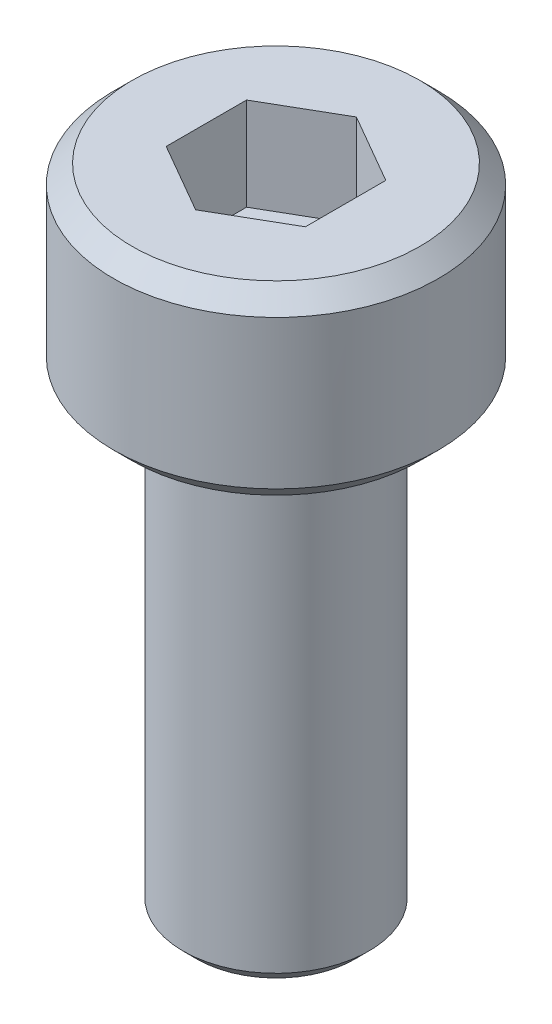
ISO-10303-21;
HEADER;
FILE_DESCRIPTION(('STEP AP214'),'2;1');
FILE_NAME('part.step','',(''),(''),'','','');
FILE_SCHEMA(('AUTOMOTIVE_DESIGN { 1 0 10303 214 1 1 1 1 }'));
ENDSEC;
DATA;
#1=APPLICATION_CONTEXT('core data for automotive mechanical design processes');
#2=APPLICATION_PROTOCOL_DEFINITION('international standard','automotive_design',2000,#1);
#3=PRODUCT_CONTEXT('',#1,'mechanical');
#4=PRODUCT('Part','Part','',(#3));
#5=PRODUCT_RELATED_PRODUCT_CATEGORY('part','',(#4));
#6=PRODUCT_DEFINITION_FORMATION('','',#4);
#7=PRODUCT_DEFINITION_CONTEXT('part definition',#1,'design');
#8=PRODUCT_DEFINITION('design','',#6,#7);
#9=PRODUCT_DEFINITION_SHAPE('','',#8);
#10=(LENGTH_UNIT() NAMED_UNIT(*) SI_UNIT(.MILLI.,.METRE.));
#11=(NAMED_UNIT(*) PLANE_ANGLE_UNIT() SI_UNIT($,.RADIAN.));
#12=(NAMED_UNIT(*) SI_UNIT($,.STERADIAN.) SOLID_ANGLE_UNIT());
#13=UNCERTAINTY_MEASURE_WITH_UNIT(LENGTH_MEASURE(1.E-05),#10,'distance_accuracy_value','');
#14=(GEOMETRIC_REPRESENTATION_CONTEXT(3) GLOBAL_UNCERTAINTY_ASSIGNED_CONTEXT((#13)) GLOBAL_UNIT_ASSIGNED_CONTEXT((#10,
#11,#12)) REPRESENTATION_CONTEXT('',''));
#15=CARTESIAN_POINT('',(0.,0.,0.));
#16=DIRECTION('',(0.,0.,1.));
#17=DIRECTION('',(1.,0.,0.));
#18=AXIS2_PLACEMENT_3D('',#15,#16,#17);
#19=CARTESIAN_POINT('',(0.,2.,-1.73205080756888));
#20=DIRECTION('',(-0.500000000000001,0.,-0.866025403784438));
#21=DIRECTION('',(-0.866025403784438,0.,0.500000000000001));
#22=AXIS2_PLACEMENT_3D('',#19,#20,#21);
#23=PLANE('',#22);
#24=DIRECTION('',(0.,1.,0.));
#25=VECTOR('',#24,1.);
#26=CARTESIAN_POINT('',(-1.5,2.,-0.866025403784438));
#27=LINE('',#26,#25);
#28=CARTESIAN_POINT('',(-1.5,4.,-0.866025403784437));
#29=VERTEX_POINT('',#28);
#30=CARTESIAN_POINT('',(-1.5,2.,-0.866025403784437));
#31=VERTEX_POINT('',#30);
#32=EDGE_CURVE('E97',#29,#31,#27,.F.);
#33=ORIENTED_EDGE('',*,*,#32,.T.);
#34=DIRECTION('',(-0.866025403784438,0.,0.500000000000001));
#35=VECTOR('',#34,1.);
#36=CARTESIAN_POINT('',(0.,2.,-1.73205080756888));
#37=LINE('',#36,#35);
#38=CARTESIAN_POINT('',(0.,2.,-1.73205080756888));
#39=VERTEX_POINT('',#38);
#40=EDGE_CURVE('E85',#39,#31,#37,.T.);
#41=ORIENTED_EDGE('',*,*,#40,.F.);
#42=DIRECTION('',(0.,1.,0.));
#43=VECTOR('',#42,1.);
#44=CARTESIAN_POINT('',(0.,2.,-1.73205080756888));
#45=LINE('',#44,#43);
#46=CARTESIAN_POINT('',(0.,4.,-1.73205080756888));
#47=VERTEX_POINT('',#46);
#48=EDGE_CURVE('E111',#39,#47,#45,.T.);
#49=ORIENTED_EDGE('',*,*,#48,.T.);
#50=DIRECTION('',(-0.866025403784438,0.,0.500000000000001));
#51=VECTOR('',#50,1.);
#52=CARTESIAN_POINT('',(0.,4.,-1.73205080756888));
#53=LINE('',#52,#51);
#54=EDGE_CURVE('E80',#29,#47,#53,.F.);
#55=ORIENTED_EDGE('',*,*,#54,.F.);
#56=EDGE_LOOP('',(#33,#41,#49,#55));
#57=FACE_BOUND('',#56,.T.);
#58=ADVANCED_FACE('F16',(#57),#23,.F.);
#59=CARTESIAN_POINT('',(-1.5,2.,-0.866025403784438));
#60=DIRECTION('',(-1.,0.,0.));
#61=DIRECTION('',(0.,0.,1.));
#62=AXIS2_PLACEMENT_3D('',#59,#60,#61);
#63=PLANE('',#62);
#64=DIRECTION('',(0.,1.,0.));
#65=VECTOR('',#64,1.);
#66=CARTESIAN_POINT('',(-1.5,2.,0.866025403784439));
#67=LINE('',#66,#65);
#68=CARTESIAN_POINT('',(-1.5,4.,0.866025403784439));
#69=VERTEX_POINT('',#68);
#70=CARTESIAN_POINT('',(-1.5,2.,0.866025403784439));
#71=VERTEX_POINT('',#70);
#72=EDGE_CURVE('E103',#69,#71,#67,.F.);
#73=ORIENTED_EDGE('',*,*,#72,.T.);
#74=DIRECTION('',(0.,0.,1.));
#75=VECTOR('',#74,1.);
#76=CARTESIAN_POINT('',(-1.5,2.,-0.866025403784438));
#77=LINE('',#76,#75);
#78=EDGE_CURVE('E89',#31,#71,#77,.T.);
#79=ORIENTED_EDGE('',*,*,#78,.F.);
#80=ORIENTED_EDGE('',*,*,#32,.F.);
#81=DIRECTION('',(0.,0.,1.));
#82=VECTOR('',#81,1.);
#83=CARTESIAN_POINT('',(-1.5,4.,-0.866025403784438));
#84=LINE('',#83,#82);
#85=EDGE_CURVE('E106',#69,#29,#84,.F.);
#86=ORIENTED_EDGE('',*,*,#85,.F.);
#87=EDGE_LOOP('',(#73,#79,#80,#86));
#88=FACE_BOUND('',#87,.T.);
#89=ADVANCED_FACE('F101',(#88),#63,.F.);
#90=CARTESIAN_POINT('',(1.5,2.,-0.866025403784438));
#91=DIRECTION('',(0.5,0.,-0.866025403784439));
#92=DIRECTION('',(-0.866025403784439,0.,-0.5));
#93=AXIS2_PLACEMENT_3D('',#90,#91,#92);
#94=PLANE('',#93);
#95=ORIENTED_EDGE('',*,*,#48,.F.);
#96=DIRECTION('',(-0.866025403784439,0.,-0.5));
#97=VECTOR('',#96,1.);
#98=CARTESIAN_POINT('',(1.5,2.,-0.866025403784438));
#99=LINE('',#98,#97);
#100=CARTESIAN_POINT('',(1.5,2.,-0.866025403784438));
#101=VERTEX_POINT('',#100);
#102=EDGE_CURVE('E92',#101,#39,#99,.T.);
#103=ORIENTED_EDGE('',*,*,#102,.F.);
#104=DIRECTION('',(0.,1.,0.));
#105=VECTOR('',#104,1.);
#106=CARTESIAN_POINT('',(1.5,2.,-0.866025403784438));
#107=LINE('',#106,#105);
#108=CARTESIAN_POINT('',(1.5,4.,-0.866025403784438));
#109=VERTEX_POINT('',#108);
#110=EDGE_CURVE('E153',#101,#109,#107,.T.);
#111=ORIENTED_EDGE('',*,*,#110,.T.);
#112=DIRECTION('',(-0.866025403784439,0.,-0.5));
#113=VECTOR('',#112,1.);
#114=CARTESIAN_POINT('',(1.5,4.,-0.866025403784438));
#115=LINE('',#114,#113);
#116=EDGE_CURVE('E169',#47,#109,#115,.F.);
#117=ORIENTED_EDGE('',*,*,#116,.F.);
#118=EDGE_LOOP('',(#95,#103,#111,#117));
#119=FACE_BOUND('',#118,.T.);
#120=ADVANCED_FACE('F174',(#119),#94,.F.);
#121=CARTESIAN_POINT('',(-1.5,2.,0.866025403784439));
#122=DIRECTION('',(-0.499999999999999,0.,0.866025403784439));
#123=DIRECTION('',(0.866025403784439,0.,0.499999999999999));
#124=AXIS2_PLACEMENT_3D('',#121,#122,#123);
#125=PLANE('',#124);
#126=DIRECTION('',(0.,1.,0.));
#127=VECTOR('',#126,1.);
#128=CARTESIAN_POINT('',(0.,2.,1.73205080756888));
#129=LINE('',#128,#127);
#130=CARTESIAN_POINT('',(0.,4.,1.73205080756888));
#131=VERTEX_POINT('',#130);
#132=CARTESIAN_POINT('',(0.,2.,1.73205080756888));
#133=VERTEX_POINT('',#132);
#134=EDGE_CURVE('E149',#131,#133,#129,.F.);
#135=ORIENTED_EDGE('',*,*,#134,.T.);
#136=DIRECTION('',(0.866025403784439,0.,0.499999999999999));
#137=VECTOR('',#136,1.);
#138=CARTESIAN_POINT('',(-1.5,2.,0.866025403784439));
#139=LINE('',#138,#137);
#140=EDGE_CURVE('E161',#71,#133,#139,.T.);
#141=ORIENTED_EDGE('',*,*,#140,.F.);
#142=ORIENTED_EDGE('',*,*,#72,.F.);
#143=DIRECTION('',(0.866025403784439,0.,0.499999999999999));
#144=VECTOR('',#143,1.);
#145=CARTESIAN_POINT('',(-1.5,4.,0.866025403784439));
#146=LINE('',#145,#144);
#147=EDGE_CURVE('E164',#131,#69,#146,.F.);
#148=ORIENTED_EDGE('',*,*,#147,.F.);
#149=EDGE_LOOP('',(#135,#141,#142,#148));
#150=FACE_BOUND('',#149,.T.);
#151=ADVANCED_FACE('F181',(#150),#125,.F.);
#152=CARTESIAN_POINT('',(1.5,2.,2.59807621135331));
#153=DIRECTION('',(0.,1.,0.));
#154=DIRECTION('',(0.,0.,1.));
#155=AXIS2_PLACEMENT_3D('',#152,#153,#154);
#156=PLANE('',#155);
#157=ORIENTED_EDGE('',*,*,#40,.T.);
#158=ORIENTED_EDGE('',*,*,#78,.T.);
#159=ORIENTED_EDGE('',*,*,#140,.T.);
#160=DIRECTION('',(0.866025403784438,0.,-0.5));
#161=VECTOR('',#160,1.);
#162=CARTESIAN_POINT('',(0.,2.,1.73205080756888));
#163=LINE('',#162,#161);
#164=CARTESIAN_POINT('',(1.5,2.,0.866025403784438));
#165=VERTEX_POINT('',#164);
#166=EDGE_CURVE('E146',#133,#165,#163,.T.);
#167=ORIENTED_EDGE('',*,*,#166,.T.);
#168=DIRECTION('',(0.,0.,-1.));
#169=VECTOR('',#168,1.);
#170=CARTESIAN_POINT('',(1.5,2.,0.866025403784438));
#171=LINE('',#170,#169);
#172=EDGE_CURVE('E157',#165,#101,#171,.T.);
#173=ORIENTED_EDGE('',*,*,#172,.T.);
#174=ORIENTED_EDGE('',*,*,#102,.T.);
#175=EDGE_LOOP('',(#157,#158,#159,#167,#173,#174));
#176=FACE_BOUND('',#175,.T.);
#177=ADVANCED_FACE('F86',(#176),#156,.T.);
#178=CARTESIAN_POINT('',(1.5,2.,0.866025403784438));
#179=DIRECTION('',(1.,0.,0.));
#180=DIRECTION('',(0.,0.,-1.));
#181=AXIS2_PLACEMENT_3D('',#178,#179,#180);
#182=PLANE('',#181);
#183=ORIENTED_EDGE('',*,*,#110,.F.);
#184=ORIENTED_EDGE('',*,*,#172,.F.);
#185=DIRECTION('',(0.,1.,0.));
#186=VECTOR('',#185,1.);
#187=CARTESIAN_POINT('',(1.5,2.,0.866025403784437));
#188=LINE('',#187,#186);
#189=CARTESIAN_POINT('',(1.5,4.,0.866025403784438));
#190=VERTEX_POINT('',#189);
#191=EDGE_CURVE('E143',#165,#190,#188,.T.);
#192=ORIENTED_EDGE('',*,*,#191,.T.);
#193=DIRECTION('',(0.,0.,-1.));
#194=VECTOR('',#193,1.);
#195=CARTESIAN_POINT('',(1.5,4.,0.866025403784438));
#196=LINE('',#195,#194);
#197=EDGE_CURVE('E39',#109,#190,#196,.F.);
#198=ORIENTED_EDGE('',*,*,#197,.F.);
#199=EDGE_LOOP('',(#183,#184,#192,#198));
#200=FACE_BOUND('',#199,.T.);
#201=ADVANCED_FACE('F188',(#200),#182,.F.);
#202=CARTESIAN_POINT('',(0.,2.,1.73205080756888));
#203=DIRECTION('',(0.5,0.,0.866025403784438));
#204=DIRECTION('',(0.866025403784438,0.,-0.5));
#205=AXIS2_PLACEMENT_3D('',#202,#203,#204);
#206=PLANE('',#205);
#207=ORIENTED_EDGE('',*,*,#191,.F.);
#208=ORIENTED_EDGE('',*,*,#166,.F.);
#209=ORIENTED_EDGE('',*,*,#134,.F.);
#210=DIRECTION('',(-0.866025403784438,0.,0.5));
#211=VECTOR('',#210,1.);
#212=CARTESIAN_POINT('',(1.5,4.,0.866025403784438));
#213=LINE('',#212,#211);
#214=EDGE_CURVE('E140',#190,#131,#213,.T.);
#215=ORIENTED_EDGE('',*,*,#214,.F.);
#216=EDGE_LOOP('',(#207,#208,#209,#215));
#217=FACE_BOUND('',#216,.T.);
#218=ADVANCED_FACE('F186',(#217),#206,.F.);
#219=CARTESIAN_POINT('',(0.,4.,0.));
#220=DIRECTION('',(0.,1.,0.));
#221=DIRECTION('',(0.,0.,1.));
#222=AXIS2_PLACEMENT_3D('',#219,#220,#221);
#223=PLANE('',#222);
#224=ORIENTED_EDGE('',*,*,#197,.T.);
#225=ORIENTED_EDGE('',*,*,#214,.T.);
#226=ORIENTED_EDGE('',*,*,#147,.T.);
#227=ORIENTED_EDGE('',*,*,#85,.T.);
#228=ORIENTED_EDGE('',*,*,#54,.T.);
#229=ORIENTED_EDGE('',*,*,#116,.T.);
#230=EDGE_LOOP('',(#224,#225,#226,#227,#228,#229));
#231=FACE_BOUND('',#230,.T.);
#232=CARTESIAN_POINT('',(0.,4.0000000000191,0.));
#233=DIRECTION('',(0.,-1.,0.));
#234=DIRECTION('',(0.,0.,-1.));
#235=AXIS2_PLACEMENT_3D('',#232,#233,#234);
#236=CIRCLE('',#235,3.10000000001764);
#237=CARTESIAN_POINT('',(0.,4.0000000000191,-3.10000000001764));
#238=VERTEX_POINT('',#237);
#239=EDGE_CURVE('E19',#238,#238,#236,.T.);
#240=ORIENTED_EDGE('',*,*,#239,.F.);
#241=EDGE_LOOP('',(#240));
#242=FACE_BOUND('',#241,.T.);
#243=ADVANCED_FACE('F176',(#231,#242),#223,.T.);
#244=CARTESIAN_POINT('',(0.,3.60000000000582,0.));
#245=DIRECTION('',(0.,-1.,0.));
#246=DIRECTION('',(0.,0.,-1.));
#247=AXIS2_PLACEMENT_3D('',#244,#245,#246);
#248=CONICAL_SURFACE('',#247,3.50000000003092,0.785398163397448);
#249=ORIENTED_EDGE('',*,*,#239,.T.);
#250=EDGE_LOOP('',(#249));
#251=FACE_BOUND('',#250,.T.);
#252=CARTESIAN_POINT('',(0.,3.6,0.));
#253=DIRECTION('',(0.,-1.,0.));
#254=DIRECTION('',(0.,0.,-1.));
#255=AXIS2_PLACEMENT_3D('',#252,#253,#254);
#256=CIRCLE('',#255,3.5);
#257=CARTESIAN_POINT('',(0.,3.6,-3.5));
#258=VERTEX_POINT('',#257);
#259=EDGE_CURVE('E130',#258,#258,#256,.T.);
#260=ORIENTED_EDGE('',*,*,#259,.F.);
#261=EDGE_LOOP('',(#260));
#262=FACE_BOUND('',#261,.T.);
#263=ADVANCED_FACE('F225',(#251,#262),#248,.T.);
#264=CARTESIAN_POINT('',(0.,4.,0.));
#265=DIRECTION('',(0.,-1.,0.));
#266=DIRECTION('',(0.,0.,-1.));
#267=AXIS2_PLACEMENT_3D('',#264,#265,#266);
#268=CYLINDRICAL_SURFACE('',#267,3.5);
#269=ORIENTED_EDGE('',*,*,#259,.T.);
#270=EDGE_LOOP('',(#269));
#271=FACE_BOUND('',#270,.T.);
#272=CARTESIAN_POINT('',(0.,0.400000000013279,0.));
#273=DIRECTION('',(0.,1.,0.));
#274=DIRECTION('',(0.,0.,1.));
#275=AXIS2_PLACEMENT_3D('',#272,#273,#274);
#276=CIRCLE('',#275,3.50000000003092);
#277=CARTESIAN_POINT('',(0.,0.400000000013279,3.50000000003092));
#278=VERTEX_POINT('',#277);
#279=EDGE_CURVE('E123',#278,#278,#276,.F.);
#280=ORIENTED_EDGE('',*,*,#279,.F.);
#281=EDGE_LOOP('',(#280));
#282=FACE_BOUND('',#281,.T.);
#283=ADVANCED_FACE('F221',(#271,#282),#268,.T.);
#284=CARTESIAN_POINT('',(0.,-10.,0.));
#285=DIRECTION('',(0.,1.,0.));
#286=DIRECTION('',(0.,0.,1.));
#287=AXIS2_PLACEMENT_3D('',#284,#285,#286);
#288=PLANE('',#287);
#289=CARTESIAN_POINT('',(0.,-9.99999999999091,0.));
#290=DIRECTION('',(0.,1.,0.));
#291=DIRECTION('',(0.,0.,1.));
#292=AXIS2_PLACEMENT_3D('',#289,#290,#291);
#293=CIRCLE('',#292,1.70000000008486);
#294=CARTESIAN_POINT('',(0.,-9.99999999999091,1.70000000008486));
#295=VERTEX_POINT('',#294);
#296=EDGE_CURVE('E120',#295,#295,#293,.T.);
#297=ORIENTED_EDGE('',*,*,#296,.F.);
#298=EDGE_LOOP('',(#297));
#299=FACE_BOUND('',#298,.T.);
#300=ADVANCED_FACE('F217',(#299),#288,.F.);
#301=CARTESIAN_POINT('',(0.,0.399999999956435,0.));
#302=DIRECTION('',(0.,1.,0.));
#303=DIRECTION('',(0.,0.,1.));
#304=AXIS2_PLACEMENT_3D('',#301,#302,#303);
#305=CONICAL_SURFACE('',#304,3.49999999991724,0.785398163326394);
#306=CARTESIAN_POINT('',(0.,5.6843418860808E-11,0.));
#307=DIRECTION('',(0.,1.,0.));
#308=DIRECTION('',(0.,0.,1.));
#309=AXIS2_PLACEMENT_3D('',#306,#307,#308);
#310=CIRCLE('',#309,3.10000000007449);
#311=CARTESIAN_POINT('',(0.,5.6843418860808E-11,3.10000000007449));
#312=VERTEX_POINT('',#311);
#313=EDGE_CURVE('E117',#312,#312,#310,.T.);
#314=ORIENTED_EDGE('',*,*,#313,.T.);
#315=EDGE_LOOP('',(#314));
#316=FACE_BOUND('',#315,.T.);
#317=ORIENTED_EDGE('',*,*,#279,.T.);
#318=EDGE_LOOP('',(#317));
#319=FACE_BOUND('',#318,.T.);
#320=ADVANCED_FACE('F213',(#316,#319),#305,.T.);
#321=CARTESIAN_POINT('',(0.,-9.70000000012305,0.));
#322=DIRECTION('',(0.,1.,0.));
#323=DIRECTION('',(0.,0.,1.));
#324=AXIS2_PLACEMENT_3D('',#321,#322,#323);
#325=CONICAL_SURFACE('',#324,1.99999999995271,0.785398163397448);
#326=CARTESIAN_POINT('',(0.,-9.7,0.));
#327=DIRECTION('',(0.,1.,0.));
#328=DIRECTION('',(0.,0.,1.));
#329=AXIS2_PLACEMENT_3D('',#326,#327,#328);
#330=CIRCLE('',#329,2.);
#331=CARTESIAN_POINT('',(0.,-9.7,2.));
#332=VERTEX_POINT('',#331);
#333=EDGE_CURVE('E26',#332,#332,#330,.T.);
#334=ORIENTED_EDGE('',*,*,#333,.F.);
#335=EDGE_LOOP('',(#334));
#336=FACE_BOUND('',#335,.T.);
#337=ORIENTED_EDGE('',*,*,#296,.T.);
#338=EDGE_LOOP('',(#337));
#339=FACE_BOUND('',#338,.T.);
#340=ADVANCED_FACE('F206',(#336,#339),#325,.T.);
#341=CARTESIAN_POINT('',(0.,0.,0.));
#342=DIRECTION('',(0.,1.,0.));
#343=DIRECTION('',(0.,0.,1.));
#344=AXIS2_PLACEMENT_3D('',#341,#342,#343);
#345=PLANE('',#344);
#346=CARTESIAN_POINT('',(0.,0.,0.));
#347=DIRECTION('',(0.,1.,0.));
#348=DIRECTION('',(0.,0.,1.));
#349=AXIS2_PLACEMENT_3D('',#346,#347,#348);
#350=CIRCLE('',#349,2.);
#351=CARTESIAN_POINT('',(0.,0.,2.));
#352=VERTEX_POINT('',#351);
#353=EDGE_CURVE('E11',#352,#352,#350,.F.);
#354=ORIENTED_EDGE('',*,*,#353,.F.);
#355=EDGE_LOOP('',(#354));
#356=FACE_BOUND('',#355,.T.);
#357=ORIENTED_EDGE('',*,*,#313,.F.);
#358=EDGE_LOOP('',(#357));
#359=FACE_BOUND('',#358,.T.);
#360=ADVANCED_FACE('F200',(#356,#359),#345,.F.);
#361=CARTESIAN_POINT('',(0.,-10.,0.));
#362=DIRECTION('',(0.,1.,0.));
#363=DIRECTION('',(0.,0.,1.));
#364=AXIS2_PLACEMENT_3D('',#361,#362,#363);
#365=CYLINDRICAL_SURFACE('',#364,2.);
#366=ORIENTED_EDGE('',*,*,#353,.T.);
#367=EDGE_LOOP('',(#366));
#368=FACE_BOUND('',#367,.T.);
#369=ORIENTED_EDGE('',*,*,#333,.T.);
#370=EDGE_LOOP('',(#369));
#371=FACE_BOUND('',#370,.T.);
#372=ADVANCED_FACE('F198',(#368,#371),#365,.T.);
#373=CLOSED_SHELL('',(#58,#89,#120,#151,#177,#201,#218,#243,#263,#283,#300,#320,#340,#360,#372));
#374=MANIFOLD_SOLID_BREP('B1',#373);
#375=ADVANCED_BREP_SHAPE_REPRESENTATION('',(#18,#374),#14);
#376=SHAPE_DEFINITION_REPRESENTATION(#9,#375);
ENDSEC;
END-ISO-10303-21;
